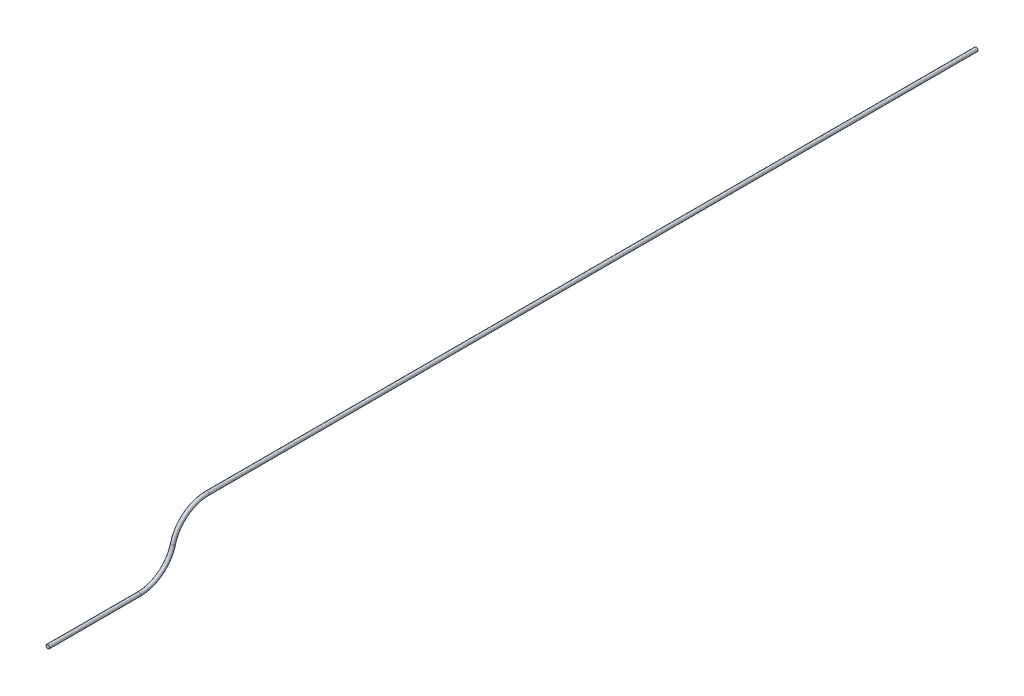
ISO-10303-21;
HEADER;
FILE_DESCRIPTION(('STEP AP214'),'2;1');
FILE_NAME('part.step','',(''),(''),'','','');
FILE_SCHEMA(('AUTOMOTIVE_DESIGN { 1 0 10303 214 1 1 1 1 }'));
ENDSEC;
DATA;
#1=APPLICATION_CONTEXT('core data for automotive mechanical design processes');
#2=APPLICATION_PROTOCOL_DEFINITION('international standard','automotive_design',2000,#1);
#3=PRODUCT_CONTEXT('',#1,'mechanical');
#4=PRODUCT('Part','Part','',(#3));
#5=PRODUCT_RELATED_PRODUCT_CATEGORY('part','',(#4));
#6=PRODUCT_DEFINITION_FORMATION('','',#4);
#7=PRODUCT_DEFINITION_CONTEXT('part definition',#1,'design');
#8=PRODUCT_DEFINITION('design','',#6,#7);
#9=PRODUCT_DEFINITION_SHAPE('','',#8);
#10=(LENGTH_UNIT() NAMED_UNIT(*) SI_UNIT(.MILLI.,.METRE.));
#11=(NAMED_UNIT(*) PLANE_ANGLE_UNIT() SI_UNIT($,.RADIAN.));
#12=(NAMED_UNIT(*) SI_UNIT($,.STERADIAN.) SOLID_ANGLE_UNIT());
#13=UNCERTAINTY_MEASURE_WITH_UNIT(LENGTH_MEASURE(1.E-05),#10,'distance_accuracy_value','');
#14=(GEOMETRIC_REPRESENTATION_CONTEXT(3) GLOBAL_UNCERTAINTY_ASSIGNED_CONTEXT((#13)) GLOBAL_UNIT_ASSIGNED_CONTEXT((#10,
#11,#12)) REPRESENTATION_CONTEXT('',''));
#15=CARTESIAN_POINT('',(0.,0.,0.));
#16=DIRECTION('',(0.,0.,1.));
#17=DIRECTION('',(1.,0.,0.));
#18=AXIS2_PLACEMENT_3D('',#15,#16,#17);
#19=CARTESIAN_POINT('',(0.,114.3,-342.560665490503));
#20=DIRECTION('',(0.,0.,-1.));
#21=DIRECTION('',(-1.,0.,0.));
#22=AXIS2_PLACEMENT_3D('',#19,#20,#21);
#23=CYLINDRICAL_SURFACE('',#22,4.03225);
#24=CARTESIAN_POINT('',(0.,114.3,-342.560665490503));
#25=DIRECTION('',(0.,0.,1.));
#26=DIRECTION('',(1.,0.,0.));
#27=AXIS2_PLACEMENT_3D('',#24,#25,#26);
#28=CIRCLE('',#27,4.03225);
#29=CARTESIAN_POINT('',(0.,118.33225,-342.560665490503));
#30=VERTEX_POINT('',#29);
#31=EDGE_CURVE('E47',#30,#30,#28,.T.);
#32=ORIENTED_EDGE('',*,*,#31,.F.);
#33=EDGE_LOOP('',(#32));
#34=FACE_BOUND('',#33,.T.);
#35=CARTESIAN_POINT('',(0.,114.3,-1993.5606654905));
#36=DIRECTION('',(0.,0.,1.));
#37=DIRECTION('',(1.,0.,0.));
#38=AXIS2_PLACEMENT_3D('',#35,#36,#37);
#39=CIRCLE('',#38,4.03225);
#40=CARTESIAN_POINT('',(4.03225,114.3,-1993.5606654905));
#41=VERTEX_POINT('',#40);
#42=EDGE_CURVE('E10',#41,#41,#39,.T.);
#43=ORIENTED_EDGE('',*,*,#42,.T.);
#44=EDGE_LOOP('',(#43));
#45=FACE_BOUND('',#44,.T.);
#46=ADVANCED_FACE('F41',(#34,#45),#23,.T.);
#47=CARTESIAN_POINT('',(0.,38.1,-342.560665490503));
#48=DIRECTION('',(-1.,0.,0.));
#49=DIRECTION('',(0.,0.,1.));
#50=AXIS2_PLACEMENT_3D('',#47,#48,#49);
#51=TOROIDAL_SURFACE('',#50,76.2,4.03225);
#52=CARTESIAN_POINT('',(0.,57.15,-268.780332745251));
#53=DIRECTION('',(0.,-0.968245836551854,0.25));
#54=DIRECTION('',(1.,0.,0.));
#55=AXIS2_PLACEMENT_3D('',#52,#53,#54);
#56=CIRCLE('',#55,4.03225);
#57=CARTESIAN_POINT('',(0.,58.1580625,-264.876123470815));
#58=VERTEX_POINT('',#57);
#59=EDGE_CURVE('E52',#58,#58,#56,.T.);
#60=CARTESIAN_POINT('',(0.,38.1,-342.560665490503));
#61=DIRECTION('',(-1.,0.,0.));
#62=DIRECTION('',(0.,0.,1.));
#63=AXIS2_PLACEMENT_3D('',#60,#61,#62);
#64=CIRCLE('',#63,80.23225);
#65=EDGE_CURVE('',#58,#30,#64,.T.);
#66=ORIENTED_EDGE('',*,*,#59,.F.);
#67=ORIENTED_EDGE('',*,*,#31,.T.);
#68=ORIENTED_EDGE('',*,*,#65,.T.);
#69=ORIENTED_EDGE('',*,*,#65,.F.);
#70=EDGE_LOOP('',(#66,#68,#67,#69));
#71=FACE_BOUND('',#70,.T.);
#72=ADVANCED_FACE('F74',(#71),#51,.T.);
#73=CARTESIAN_POINT('',(0.,76.2,-195.));
#74=DIRECTION('',(1.,0.,0.));
#75=DIRECTION('',(0.,0.,-1.));
#76=AXIS2_PLACEMENT_3D('',#73,#74,#75);
#77=TOROIDAL_SURFACE('',#76,76.2,4.03225);
#78=CARTESIAN_POINT('',(0.,0.,-195.));
#79=DIRECTION('',(0.,0.,1.));
#80=DIRECTION('',(1.,0.,0.));
#81=AXIS2_PLACEMENT_3D('',#78,#79,#80);
#82=CIRCLE('',#81,4.03225);
#83=CARTESIAN_POINT('',(4.03225,0.,-195.));
#84=VERTEX_POINT('',#83);
#85=EDGE_CURVE('E57',#84,#84,#82,.T.);
#86=ORIENTED_EDGE('',*,*,#85,.F.);
#87=EDGE_LOOP('',(#86));
#88=FACE_BOUND('',#87,.T.);
#89=ORIENTED_EDGE('',*,*,#59,.T.);
#90=EDGE_LOOP('',(#89));
#91=FACE_BOUND('',#90,.T.);
#92=ADVANCED_FACE('F71',(#88,#91),#77,.T.);
#93=CARTESIAN_POINT('',(0.,0.,-195.));
#94=DIRECTION('',(0.,0.,1.));
#95=DIRECTION('',(1.,0.,0.));
#96=AXIS2_PLACEMENT_3D('',#93,#94,#95);
#97=CYLINDRICAL_SURFACE('',#96,4.03225);
#98=ORIENTED_EDGE('',*,*,#85,.T.);
#99=EDGE_LOOP('',(#98));
#100=FACE_BOUND('',#99,.T.);
#101=CARTESIAN_POINT('',(0.,0.,0.));
#102=DIRECTION('',(0.,0.,1.));
#103=DIRECTION('',(1.,0.,0.));
#104=AXIS2_PLACEMENT_3D('',#101,#102,#103);
#105=CIRCLE('',#104,4.03225);
#106=CARTESIAN_POINT('',(4.03225,0.,0.));
#107=VERTEX_POINT('',#106);
#108=EDGE_CURVE('E60',#107,#107,#105,.T.);
#109=ORIENTED_EDGE('',*,*,#108,.F.);
#110=EDGE_LOOP('',(#109));
#111=FACE_BOUND('',#110,.T.);
#112=ADVANCED_FACE('F68',(#100,#111),#97,.T.);
#113=CARTESIAN_POINT('',(0.,114.3,-1993.5606654905));
#114=DIRECTION('',(0.,0.,1.));
#115=DIRECTION('',(1.,0.,0.));
#116=AXIS2_PLACEMENT_3D('',#113,#114,#115);
#117=PLANE('',#116);
#118=ORIENTED_EDGE('',*,*,#42,.F.);
#119=EDGE_LOOP('',(#118));
#120=FACE_BOUND('',#119,.T.);
#121=ADVANCED_FACE('F86',(#120),#117,.F.);
#122=CARTESIAN_POINT('',(0.,0.,0.));
#123=DIRECTION('',(0.,0.,1.));
#124=DIRECTION('',(1.,0.,0.));
#125=AXIS2_PLACEMENT_3D('',#122,#123,#124);
#126=PLANE('',#125);
#127=ORIENTED_EDGE('',*,*,#108,.T.);
#128=EDGE_LOOP('',(#127));
#129=FACE_BOUND('',#128,.T.);
#130=ADVANCED_FACE('F87',(#129),#126,.T.);
#131=CLOSED_SHELL('',(#46,#72,#92,#112,#121,#130));
#132=MANIFOLD_SOLID_BREP('B2',#131);
#133=ADVANCED_BREP_SHAPE_REPRESENTATION('',(#18,#132),#14);
#134=SHAPE_DEFINITION_REPRESENTATION(#9,#133);
ENDSEC;
END-ISO-10303-21;
